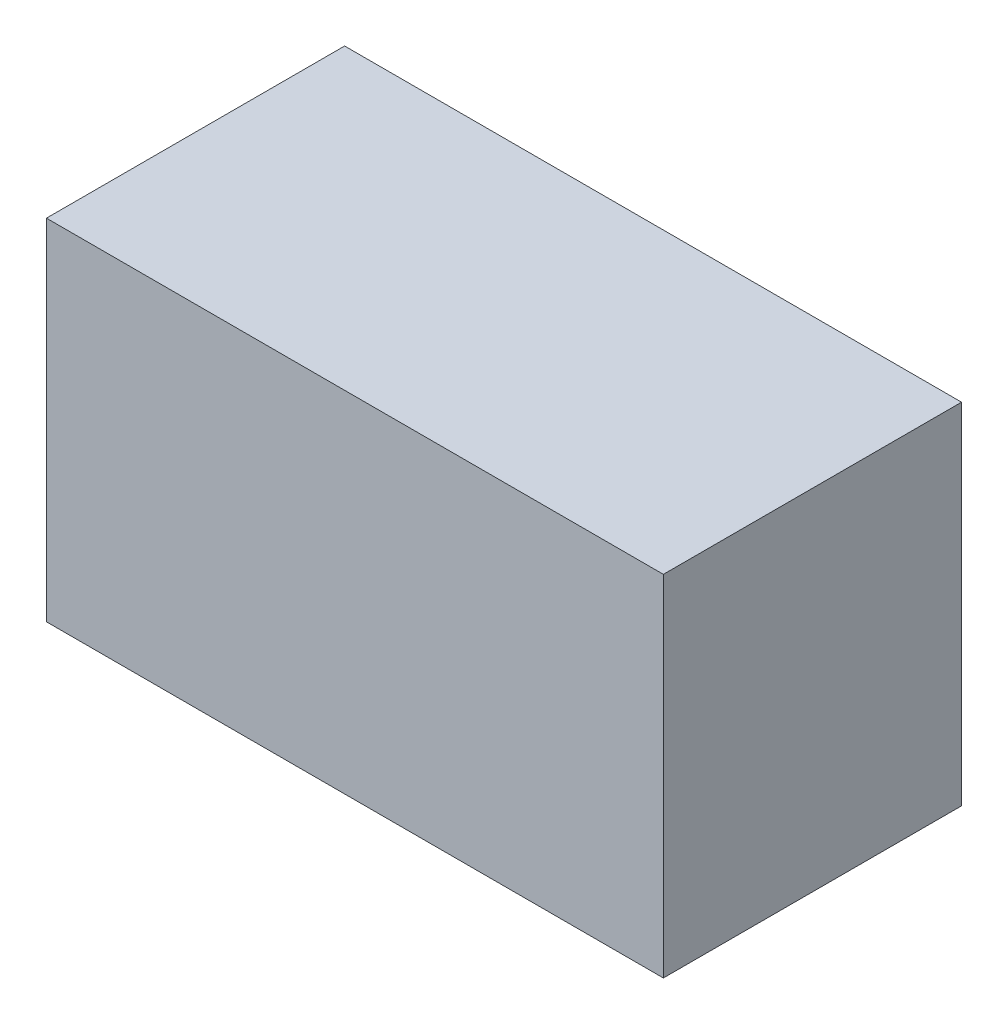
ISO-10303-21;
HEADER;
FILE_DESCRIPTION(('STEP AP214'),'2;1');
FILE_NAME('part.step','',(''),(''),'','','');
FILE_SCHEMA(('AUTOMOTIVE_DESIGN { 1 0 10303 214 1 1 1 1 }'));
ENDSEC;
DATA;
#1=APPLICATION_CONTEXT('core data for automotive mechanical design processes');
#2=APPLICATION_PROTOCOL_DEFINITION('international standard','automotive_design',2000,#1);
#3=PRODUCT_CONTEXT('',#1,'mechanical');
#4=PRODUCT('Part','Part','',(#3));
#5=PRODUCT_RELATED_PRODUCT_CATEGORY('part','',(#4));
#6=PRODUCT_DEFINITION_FORMATION('','',#4);
#7=PRODUCT_DEFINITION_CONTEXT('part definition',#1,'design');
#8=PRODUCT_DEFINITION('design','',#6,#7);
#9=PRODUCT_DEFINITION_SHAPE('','',#8);
#10=(LENGTH_UNIT() NAMED_UNIT(*) SI_UNIT(.MILLI.,.METRE.));
#11=(NAMED_UNIT(*) PLANE_ANGLE_UNIT() SI_UNIT($,.RADIAN.));
#12=(NAMED_UNIT(*) SI_UNIT($,.STERADIAN.) SOLID_ANGLE_UNIT());
#13=UNCERTAINTY_MEASURE_WITH_UNIT(LENGTH_MEASURE(1.E-05),#10,'distance_accuracy_value','');
#14=(GEOMETRIC_REPRESENTATION_CONTEXT(3) GLOBAL_UNCERTAINTY_ASSIGNED_CONTEXT((#13)) GLOBAL_UNIT_ASSIGNED_CONTEXT((#10,
#11,#12)) REPRESENTATION_CONTEXT('',''));
#15=CARTESIAN_POINT('',(0.,0.,0.));
#16=DIRECTION('',(0.,0.,1.));
#17=DIRECTION('',(1.,0.,0.));
#18=AXIS2_PLACEMENT_3D('',#15,#16,#17);
#19=CARTESIAN_POINT('',(-1.499997,-0.85000084,1.44999964));
#20=DIRECTION('',(0.,0.,-1.));
#21=DIRECTION('',(-1.,0.,0.));
#22=AXIS2_PLACEMENT_3D('',#19,#20,#21);
#23=PLANE('',#22);
#24=DIRECTION('',(0.,1.,0.));
#25=VECTOR('',#24,1.);
#26=CARTESIAN_POINT('',(1.50000208,-0.85000084,1.44999964));
#27=LINE('',#26,#25);
#28=CARTESIAN_POINT('',(1.50000208,-0.85000084,1.44999964));
#29=VERTEX_POINT('',#28);
#30=CARTESIAN_POINT('',(1.50000208,0.84999957,1.44999964));
#31=VERTEX_POINT('',#30);
#32=EDGE_CURVE('E54',#29,#31,#27,.T.);
#33=ORIENTED_EDGE('',*,*,#32,.T.);
#34=DIRECTION('',(0.999999999999642,8.46666208465197E-07,0.));
#35=VECTOR('',#34,1.);
#36=CARTESIAN_POINT('',(1.50000208,0.85000084,1.44999964));
#37=LINE('',#36,#35);
#38=CARTESIAN_POINT('',(-1.49999827,0.849998300000001,1.44999964));
#39=VERTEX_POINT('',#38);
#40=EDGE_CURVE('E56',#31,#39,#37,.F.);
#41=ORIENTED_EDGE('',*,*,#40,.T.);
#42=DIRECTION('',(-1.49411840113883E-06,0.999999999998884,0.));
#43=VECTOR('',#42,1.);
#44=CARTESIAN_POINT('',(-1.49999954,0.8499983,1.44999964));
#45=LINE('',#44,#43);
#46=CARTESIAN_POINT('',(-1.499997,-0.85000084,1.44999964));
#47=VERTEX_POINT('',#46);
#48=EDGE_CURVE('E19',#39,#47,#45,.F.);
#49=ORIENTED_EDGE('',*,*,#48,.T.);
#50=DIRECTION('',(1.,0.,0.));
#51=VECTOR('',#50,1.);
#52=CARTESIAN_POINT('',(-1.499997,-0.85000084,1.44999964));
#53=LINE('',#52,#51);
#54=EDGE_CURVE('E79',#47,#29,#53,.T.);
#55=ORIENTED_EDGE('',*,*,#54,.T.);
#56=EDGE_LOOP('',(#33,#41,#49,#55));
#57=FACE_BOUND('',#56,.T.);
#58=ADVANCED_FACE('F16',(#57),#23,.F.);
#59=CARTESIAN_POINT('',(-1.49999954,0.8499983,0.));
#60=DIRECTION('',(0.999999999998884,1.49411840113883E-06,0.));
#61=DIRECTION('',(-1.49411840113883E-06,0.999999999998884,0.));
#62=AXIS2_PLACEMENT_3D('',#59,#60,#61);
#63=PLANE('',#62);
#64=DIRECTION('',(0.,0.,1.));
#65=VECTOR('',#64,1.);
#66=CARTESIAN_POINT('',(-1.499997,-0.85000084,0.));
#67=LINE('',#66,#65);
#68=CARTESIAN_POINT('',(-1.499997,-0.85000084,0.));
#69=VERTEX_POINT('',#68);
#70=EDGE_CURVE('E67',#69,#47,#67,.T.);
#71=ORIENTED_EDGE('',*,*,#70,.T.);
#72=ORIENTED_EDGE('',*,*,#48,.F.);
#73=DIRECTION('',(0.,0.,1.));
#74=VECTOR('',#73,1.);
#75=CARTESIAN_POINT('',(-1.49999954,0.849998300000003,0.));
#76=LINE('',#75,#74);
#77=CARTESIAN_POINT('',(-1.499998905,0.849998300000001,0.));
#78=VERTEX_POINT('',#77);
#79=EDGE_CURVE('E62',#39,#78,#76,.F.);
#80=ORIENTED_EDGE('',*,*,#79,.T.);
#81=DIRECTION('',(0.,1.,0.));
#82=VECTOR('',#81,1.);
#83=CARTESIAN_POINT('',(-1.499997,-0.85000084,0.));
#84=LINE('',#83,#82);
#85=EDGE_CURVE('E82',#69,#78,#84,.T.);
#86=ORIENTED_EDGE('',*,*,#85,.F.);
#87=EDGE_LOOP('',(#71,#72,#80,#86));
#88=FACE_BOUND('',#87,.T.);
#89=ADVANCED_FACE('F64',(#88),#63,.F.);
#90=CARTESIAN_POINT('',(1.50000208,0.85000084,0.));
#91=DIRECTION('',(8.46666208465197E-07,-0.999999999999642,0.));
#92=DIRECTION('',(0.999999999999642,8.46666208465197E-07,0.));
#93=AXIS2_PLACEMENT_3D('',#90,#91,#92);
#94=PLANE('',#93);
#95=ORIENTED_EDGE('',*,*,#79,.F.);
#96=ORIENTED_EDGE('',*,*,#40,.F.);
#97=DIRECTION('',(0.,0.,1.));
#98=VECTOR('',#97,1.);
#99=CARTESIAN_POINT('',(1.50000208,0.85000084,0.));
#100=LINE('',#99,#98);
#101=CARTESIAN_POINT('',(1.50000208,0.850000205,0.));
#102=VERTEX_POINT('',#101);
#103=EDGE_CURVE('E74',#31,#102,#100,.F.);
#104=ORIENTED_EDGE('',*,*,#103,.T.);
#105=DIRECTION('',(-1.,0.,0.));
#106=VECTOR('',#105,1.);
#107=CARTESIAN_POINT('',(-1.499997,0.8499983,0.));
#108=LINE('',#107,#106);
#109=EDGE_CURVE('E71',#78,#102,#108,.F.);
#110=ORIENTED_EDGE('',*,*,#109,.F.);
#111=EDGE_LOOP('',(#95,#96,#104,#110));
#112=FACE_BOUND('',#111,.T.);
#113=ADVANCED_FACE('F69',(#112),#94,.F.);
#114=CARTESIAN_POINT('',(1.50000208,-0.85000084,0.));
#115=DIRECTION('',(-1.,0.,0.));
#116=DIRECTION('',(0.,0.,1.));
#117=AXIS2_PLACEMENT_3D('',#114,#115,#116);
#118=PLANE('',#117);
#119=ORIENTED_EDGE('',*,*,#103,.F.);
#120=ORIENTED_EDGE('',*,*,#32,.F.);
#121=DIRECTION('',(0.,0.,1.));
#122=VECTOR('',#121,1.);
#123=CARTESIAN_POINT('',(1.50000208,-0.85000084,0.));
#124=LINE('',#123,#122);
#125=CARTESIAN_POINT('',(1.50000208,-0.85000084,0.));
#126=VERTEX_POINT('',#125);
#127=EDGE_CURVE('E34',#29,#126,#124,.F.);
#128=ORIENTED_EDGE('',*,*,#127,.T.);
#129=DIRECTION('',(0.,1.,0.));
#130=VECTOR('',#129,1.);
#131=CARTESIAN_POINT('',(1.50000208,-0.85000084,0.));
#132=LINE('',#131,#130);
#133=EDGE_CURVE('E25',#102,#126,#132,.F.);
#134=ORIENTED_EDGE('',*,*,#133,.F.);
#135=EDGE_LOOP('',(#119,#120,#128,#134));
#136=FACE_BOUND('',#135,.T.);
#137=ADVANCED_FACE('F88',(#136),#118,.F.);
#138=CARTESIAN_POINT('',(-1.499997,-0.85000084,0.));
#139=DIRECTION('',(0.,1.,0.));
#140=DIRECTION('',(0.,0.,1.));
#141=AXIS2_PLACEMENT_3D('',#138,#139,#140);
#142=PLANE('',#141);
#143=ORIENTED_EDGE('',*,*,#127,.F.);
#144=ORIENTED_EDGE('',*,*,#54,.F.);
#145=ORIENTED_EDGE('',*,*,#70,.F.);
#146=DIRECTION('',(-1.,0.,0.));
#147=VECTOR('',#146,1.);
#148=CARTESIAN_POINT('',(-1.499997,-0.85000084,0.));
#149=LINE('',#148,#147);
#150=EDGE_CURVE('E11',#126,#69,#149,.T.);
#151=ORIENTED_EDGE('',*,*,#150,.F.);
#152=EDGE_LOOP('',(#143,#144,#145,#151));
#153=FACE_BOUND('',#152,.T.);
#154=ADVANCED_FACE('F90',(#153),#142,.F.);
#155=CARTESIAN_POINT('',(-1.499997,-0.85000084,0.));
#156=DIRECTION('',(0.,0.,-1.));
#157=DIRECTION('',(-1.,0.,0.));
#158=AXIS2_PLACEMENT_3D('',#155,#156,#157);
#159=PLANE('',#158);
#160=ORIENTED_EDGE('',*,*,#133,.T.);
#161=ORIENTED_EDGE('',*,*,#150,.T.);
#162=ORIENTED_EDGE('',*,*,#85,.T.);
#163=ORIENTED_EDGE('',*,*,#109,.T.);
#164=EDGE_LOOP('',(#160,#161,#162,#163));
#165=FACE_BOUND('',#164,.T.);
#166=ADVANCED_FACE('F87',(#165),#159,.T.);
#167=CLOSED_SHELL('',(#58,#89,#113,#137,#154,#166));
#168=MANIFOLD_SOLID_BREP('B1',#167);
#169=ADVANCED_BREP_SHAPE_REPRESENTATION('',(#18,#168),#14);
#170=SHAPE_DEFINITION_REPRESENTATION(#9,#169);
ENDSEC;
END-ISO-10303-21;
